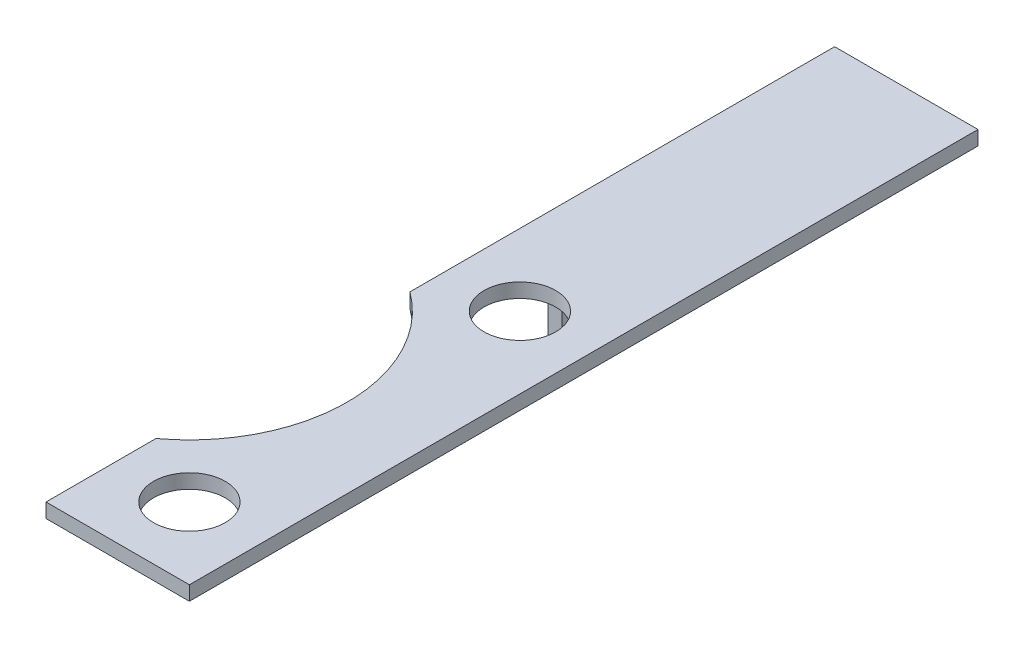
ISO-10303-21;
HEADER;
FILE_DESCRIPTION(('STEP AP214'),'2;1');
FILE_NAME('part.step','',(''),(''),'','','');
FILE_SCHEMA(('AUTOMOTIVE_DESIGN { 1 0 10303 214 1 1 1 1 }'));
ENDSEC;
DATA;
#1=APPLICATION_CONTEXT('core data for automotive mechanical design processes');
#2=APPLICATION_PROTOCOL_DEFINITION('international standard','automotive_design',2000,#1);
#3=PRODUCT_CONTEXT('',#1,'mechanical');
#4=PRODUCT('Part','Part','',(#3));
#5=PRODUCT_RELATED_PRODUCT_CATEGORY('part','',(#4));
#6=PRODUCT_DEFINITION_FORMATION('','',#4);
#7=PRODUCT_DEFINITION_CONTEXT('part definition',#1,'design');
#8=PRODUCT_DEFINITION('design','',#6,#7);
#9=PRODUCT_DEFINITION_SHAPE('','',#8);
#10=(LENGTH_UNIT() NAMED_UNIT(*) SI_UNIT(.MILLI.,.METRE.));
#11=(NAMED_UNIT(*) PLANE_ANGLE_UNIT() SI_UNIT($,.RADIAN.));
#12=(NAMED_UNIT(*) SI_UNIT($,.STERADIAN.) SOLID_ANGLE_UNIT());
#13=UNCERTAINTY_MEASURE_WITH_UNIT(LENGTH_MEASURE(1.E-05),#10,'distance_accuracy_value','');
#14=(GEOMETRIC_REPRESENTATION_CONTEXT(3) GLOBAL_UNCERTAINTY_ASSIGNED_CONTEXT((#13)) GLOBAL_UNIT_ASSIGNED_CONTEXT((#10,
#11,#12)) REPRESENTATION_CONTEXT('',''));
#15=CARTESIAN_POINT('',(0.,0.,0.));
#16=DIRECTION('',(0.,0.,1.));
#17=DIRECTION('',(1.,0.,0.));
#18=AXIS2_PLACEMENT_3D('',#15,#16,#17);
#19=CARTESIAN_POINT('',(1.,-10.,55.));
#20=DIRECTION('',(0.,1.,0.));
#21=DIRECTION('',(0.,0.,-1.));
#22=AXIS2_PLACEMENT_3D('',#19,#20,#21);
#23=PLANE('',#22);
#24=DIRECTION('',(-1.,0.,0.));
#25=VECTOR('',#24,1.);
#26=CARTESIAN_POINT('',(0.,-10.,20.));
#27=LINE('',#26,#25);
#28=CARTESIAN_POINT('',(0.999999999999999,-10.,20.));
#29=VERTEX_POINT('',#28);
#30=CARTESIAN_POINT('',(0.,-10.,20.));
#31=VERTEX_POINT('',#30);
#32=EDGE_CURVE('E146',#29,#31,#27,.T.);
#33=ORIENTED_EDGE('',*,*,#32,.T.);
#34=DIRECTION('',(0.,0.,-1.));
#35=VECTOR('',#34,1.);
#36=CARTESIAN_POINT('',(0.,-10.,55.));
#37=LINE('',#36,#35);
#38=CARTESIAN_POINT('',(0.,-10.,0.));
#39=VERTEX_POINT('',#38);
#40=EDGE_CURVE('E11',#31,#39,#37,.T.);
#41=ORIENTED_EDGE('',*,*,#40,.T.);
#42=DIRECTION('',(-1.,0.,0.));
#43=VECTOR('',#42,1.);
#44=CARTESIAN_POINT('',(1.,-10.,0.));
#45=LINE('',#44,#43);
#46=CARTESIAN_POINT('',(1.,-10.,0.));
#47=VERTEX_POINT('',#46);
#48=EDGE_CURVE('E166',#47,#39,#45,.T.);
#49=ORIENTED_EDGE('',*,*,#48,.F.);
#50=DIRECTION('',(0.,0.,-1.));
#51=VECTOR('',#50,1.);
#52=CARTESIAN_POINT('',(1.,-10.,55.));
#53=LINE('',#52,#51);
#54=EDGE_CURVE('E175',#29,#47,#53,.T.);
#55=ORIENTED_EDGE('',*,*,#54,.F.);
#56=EDGE_LOOP('',(#33,#41,#49,#55));
#57=FACE_BOUND('',#56,.T.);
#58=ADVANCED_FACE('F37',(#57),#23,.F.);
#59=CARTESIAN_POINT('',(0.,-10.,55.));
#60=DIRECTION('',(1.,0.,0.));
#61=DIRECTION('',(0.,0.,-1.));
#62=AXIS2_PLACEMENT_3D('',#59,#60,#61);
#63=PLANE('',#62);
#64=DIRECTION('',(0.,1.,0.));
#65=VECTOR('',#64,1.);
#66=CARTESIAN_POINT('',(0.,-10.,55.));
#67=LINE('',#66,#65);
#68=CARTESIAN_POINT('',(0.,-0.999999999999999,55.));
#69=VERTEX_POINT('',#68);
#70=CARTESIAN_POINT('',(0.,0.,55.));
#71=VERTEX_POINT('',#70);
#72=EDGE_CURVE('E167',#69,#71,#67,.T.);
#73=ORIENTED_EDGE('',*,*,#72,.T.);
#74=DIRECTION('',(0.,0.,-1.));
#75=VECTOR('',#74,1.);
#76=CARTESIAN_POINT('',(0.,0.,55.));
#77=LINE('',#76,#75);
#78=CARTESIAN_POINT('',(0.,0.,47.3307537793234));
#79=VERTEX_POINT('',#78);
#80=EDGE_CURVE('E44',#71,#79,#77,.T.);
#81=ORIENTED_EDGE('',*,*,#80,.T.);
#82=DIRECTION('',(0.,-1.,0.));
#83=VECTOR('',#82,1.);
#84=CARTESIAN_POINT('',(0.,0.,47.3307537793234));
#85=LINE('',#84,#83);
#86=CARTESIAN_POINT('',(0.,-0.999999999999999,47.3307537793234));
#87=VERTEX_POINT('',#86);
#88=EDGE_CURVE('E160',#87,#79,#85,.F.);
#89=ORIENTED_EDGE('',*,*,#88,.F.);
#90=DIRECTION('',(0.,0.,1.));
#91=VECTOR('',#90,1.);
#92=CARTESIAN_POINT('',(0.,-0.999999999999999,20.));
#93=LINE('',#92,#91);
#94=EDGE_CURVE('E134',#87,#69,#93,.T.);
#95=ORIENTED_EDGE('',*,*,#94,.T.);
#96=EDGE_LOOP('',(#73,#81,#89,#95));
#97=FACE_BOUND('',#96,.T.);
#98=ADVANCED_FACE('F226',(#97),#63,.F.);
#99=CARTESIAN_POINT('',(0.999999999999999,-0.999999999999999,55.));
#100=DIRECTION('',(-1.,0.,0.));
#101=DIRECTION('',(0.,1.,0.));
#102=AXIS2_PLACEMENT_3D('',#99,#100,#101);
#103=PLANE('',#102);
#104=CARTESIAN_POINT('',(0.999999999999999,-4.,5.1));
#105=DIRECTION('',(1.,0.,0.));
#106=DIRECTION('',(0.,1.,0.));
#107=AXIS2_PLACEMENT_3D('',#104,#105,#106);
#108=CIRCLE('',#107,2.25);
#109=CARTESIAN_POINT('',(0.999999999999999,-1.75,5.1));
#110=VERTEX_POINT('',#109);
#111=EDGE_CURVE('E138',#110,#110,#108,.T.);
#112=ORIENTED_EDGE('',*,*,#111,.F.);
#113=EDGE_LOOP('',(#112));
#114=FACE_BOUND('',#113,.T.);
#115=CARTESIAN_POINT('',(0.999999999999999,-4.,15.1));
#116=DIRECTION('',(1.,0.,0.));
#117=DIRECTION('',(0.,1.,0.));
#118=AXIS2_PLACEMENT_3D('',#115,#116,#117);
#119=CIRCLE('',#118,2.25);
#120=CARTESIAN_POINT('',(0.999999999999999,-1.75,15.1));
#121=VERTEX_POINT('',#120);
#122=EDGE_CURVE('E141',#121,#121,#119,.T.);
#123=ORIENTED_EDGE('',*,*,#122,.F.);
#124=EDGE_LOOP('',(#123));
#125=FACE_BOUND('',#124,.T.);
#126=DIRECTION('',(0.,-1.,0.));
#127=VECTOR('',#126,1.);
#128=CARTESIAN_POINT('',(0.999999999999999,-10.,20.));
#129=LINE('',#128,#127);
#130=CARTESIAN_POINT('',(0.999999999999999,-0.999999999999999,20.));
#131=VERTEX_POINT('',#130);
#132=EDGE_CURVE('E122',#131,#29,#129,.T.);
#133=ORIENTED_EDGE('',*,*,#132,.T.);
#134=ORIENTED_EDGE('',*,*,#54,.T.);
#135=DIRECTION('',(0.,-1.,0.));
#136=VECTOR('',#135,1.);
#137=CARTESIAN_POINT('',(0.999999999999999,-0.999999999999999,0.));
#138=LINE('',#137,#136);
#139=CARTESIAN_POINT('',(0.999999999999999,-0.999999999999999,0.));
#140=VERTEX_POINT('',#139);
#141=EDGE_CURVE('E86',#140,#47,#138,.T.);
#142=ORIENTED_EDGE('',*,*,#141,.F.);
#143=DIRECTION('',(0.,0.,-1.));
#144=VECTOR('',#143,1.);
#145=CARTESIAN_POINT('',(0.999999999999999,-0.999999999999999,55.));
#146=LINE('',#145,#144);
#147=EDGE_CURVE('E190',#131,#140,#146,.T.);
#148=ORIENTED_EDGE('',*,*,#147,.F.);
#149=EDGE_LOOP('',(#133,#134,#142,#148));
#150=FACE_BOUND('',#149,.T.);
#151=ADVANCED_FACE('F210',(#114,#125,#150),#103,.F.);
#152=CARTESIAN_POINT('',(0.,-4.,5.1));
#153=DIRECTION('',(1.,0.,0.));
#154=DIRECTION('',(0.,0.,1.));
#155=AXIS2_PLACEMENT_3D('',#152,#153,#154);
#156=CIRCLE('',#155,2.25);
#157=CARTESIAN_POINT('',(0.,-4.,7.35));
#158=VERTEX_POINT('',#157);
#159=EDGE_CURVE('E245',#158,#158,#156,.T.);
#160=ORIENTED_EDGE('',*,*,#159,.T.);
#161=EDGE_LOOP('',(#160));
#162=FACE_BOUND('',#161,.T.);
#163=CARTESIAN_POINT('',(0.,-4.,15.1));
#164=DIRECTION('',(1.,0.,0.));
#165=DIRECTION('',(0.,0.,1.));
#166=AXIS2_PLACEMENT_3D('',#163,#164,#165);
#167=CIRCLE('',#166,2.25);
#168=CARTESIAN_POINT('',(0.,-4.,17.35));
#169=VERTEX_POINT('',#168);
#170=EDGE_CURVE('E248',#169,#169,#167,.T.);
#171=ORIENTED_EDGE('',*,*,#170,.T.);
#172=EDGE_LOOP('',(#171));
#173=FACE_BOUND('',#172,.T.);
#174=DIRECTION('',(0.,-1.,0.));
#175=VECTOR('',#174,1.);
#176=CARTESIAN_POINT('',(0.,0.,29.6192462206766));
#177=LINE('',#176,#175);
#178=CARTESIAN_POINT('',(0.,0.,29.6192462206766));
#179=VERTEX_POINT('',#178);
#180=CARTESIAN_POINT('',(0.,-0.999999999999999,29.6192462206766));
#181=VERTEX_POINT('',#180);
#182=EDGE_CURVE('E164',#179,#181,#177,.T.);
#183=ORIENTED_EDGE('',*,*,#182,.F.);
#184=CARTESIAN_POINT('',(0.,0.,0.));
#185=VERTEX_POINT('',#184);
#186=EDGE_CURVE('E197',#179,#185,#77,.T.);
#187=ORIENTED_EDGE('',*,*,#186,.T.);
#188=DIRECTION('',(0.,1.,0.));
#189=VECTOR('',#188,1.);
#190=CARTESIAN_POINT('',(0.,-10.,0.));
#191=LINE('',#190,#189);
#192=EDGE_CURVE('E177',#39,#185,#191,.T.);
#193=ORIENTED_EDGE('',*,*,#192,.F.);
#194=ORIENTED_EDGE('',*,*,#40,.F.);
#195=DIRECTION('',(0.,1.,0.));
#196=VECTOR('',#195,1.);
#197=CARTESIAN_POINT('',(0.,-10.,20.));
#198=LINE('',#197,#196);
#199=CARTESIAN_POINT('',(0.,-0.999999999999999,20.));
#200=VERTEX_POINT('',#199);
#201=EDGE_CURVE('E120',#31,#200,#198,.T.);
#202=ORIENTED_EDGE('',*,*,#201,.T.);
#203=EDGE_CURVE('E128',#200,#181,#93,.T.);
#204=ORIENTED_EDGE('',*,*,#203,.T.);
#205=EDGE_LOOP('',(#183,#187,#193,#194,#202,#204));
#206=FACE_BOUND('',#205,.T.);
#207=ADVANCED_FACE('F136',(#162,#173,#206),#63,.F.);
#208=CARTESIAN_POINT('',(0.,0.,55.));
#209=DIRECTION('',(0.,-1.,0.));
#210=DIRECTION('',(0.,0.,1.));
#211=AXIS2_PLACEMENT_3D('',#208,#209,#210);
#212=PLANE('',#211);
#213=CARTESIAN_POINT('',(5.,0.,26.95));
#214=DIRECTION('',(0.,1.,0.));
#215=DIRECTION('',(-1.,0.,0.));
#216=AXIS2_PLACEMENT_3D('',#213,#214,#215);
#217=CIRCLE('',#216,2.5);
#218=CARTESIAN_POINT('',(2.5,0.,26.95));
#219=VERTEX_POINT('',#218);
#220=EDGE_CURVE('E151',#219,#219,#217,.T.);
#221=ORIENTED_EDGE('',*,*,#220,.F.);
#222=EDGE_LOOP('',(#221));
#223=FACE_BOUND('',#222,.T.);
#224=CARTESIAN_POINT('',(5.,0.,50.));
#225=DIRECTION('',(0.,1.,0.));
#226=DIRECTION('',(-1.,0.,0.));
#227=AXIS2_PLACEMENT_3D('',#224,#225,#226);
#228=CIRCLE('',#227,2.5);
#229=CARTESIAN_POINT('',(2.5,0.,50.));
#230=VERTEX_POINT('',#229);
#231=EDGE_CURVE('E157',#230,#230,#228,.T.);
#232=ORIENTED_EDGE('',*,*,#231,.F.);
#233=EDGE_LOOP('',(#232));
#234=FACE_BOUND('',#233,.T.);
#235=ORIENTED_EDGE('',*,*,#80,.F.);
#236=DIRECTION('',(1.,0.,0.));
#237=VECTOR('',#236,1.);
#238=CARTESIAN_POINT('',(0.,0.,55.));
#239=LINE('',#238,#237);
#240=CARTESIAN_POINT('',(10.,0.,55.));
#241=VERTEX_POINT('',#240);
#242=EDGE_CURVE('E90',#71,#241,#239,.T.);
#243=ORIENTED_EDGE('',*,*,#242,.T.);
#244=DIRECTION('',(0.,0.,-1.));
#245=VECTOR('',#244,1.);
#246=CARTESIAN_POINT('',(10.,0.,55.));
#247=LINE('',#246,#245);
#248=CARTESIAN_POINT('',(10.,0.,0.));
#249=VERTEX_POINT('',#248);
#250=EDGE_CURVE('E195',#241,#249,#247,.T.);
#251=ORIENTED_EDGE('',*,*,#250,.T.);
#252=DIRECTION('',(1.,0.,0.));
#253=VECTOR('',#252,1.);
#254=CARTESIAN_POINT('',(0.,0.,0.));
#255=LINE('',#254,#253);
#256=EDGE_CURVE('E180',#185,#249,#255,.T.);
#257=ORIENTED_EDGE('',*,*,#256,.F.);
#258=ORIENTED_EDGE('',*,*,#186,.F.);
#259=CARTESIAN_POINT('',(-6.525,0.,38.475));
#260=DIRECTION('',(0.,1.,0.));
#261=DIRECTION('',(1.,0.,0.));
#262=AXIS2_PLACEMENT_3D('',#259,#260,#261);
#263=CIRCLE('',#262,11.);
#264=EDGE_CURVE('E51',#79,#179,#263,.T.);
#265=ORIENTED_EDGE('',*,*,#264,.F.);
#266=EDGE_LOOP('',(#235,#243,#251,#257,#258,#265));
#267=FACE_BOUND('',#266,.T.);
#268=ADVANCED_FACE('F203',(#223,#234,#267),#212,.F.);
#269=CARTESIAN_POINT('',(10.,0.,55.));
#270=DIRECTION('',(-1.,0.,0.));
#271=DIRECTION('',(0.,0.,1.));
#272=AXIS2_PLACEMENT_3D('',#269,#270,#271);
#273=PLANE('',#272);
#274=DIRECTION('',(0.,-1.,0.));
#275=VECTOR('',#274,1.);
#276=CARTESIAN_POINT('',(10.,0.,0.));
#277=LINE('',#276,#275);
#278=CARTESIAN_POINT('',(10.,-1.,0.));
#279=VERTEX_POINT('',#278);
#280=EDGE_CURVE('E183',#249,#279,#277,.T.);
#281=ORIENTED_EDGE('',*,*,#280,.F.);
#282=ORIENTED_EDGE('',*,*,#250,.F.);
#283=DIRECTION('',(0.,-1.,0.));
#284=VECTOR('',#283,1.);
#285=CARTESIAN_POINT('',(10.,0.,55.));
#286=LINE('',#285,#284);
#287=CARTESIAN_POINT('',(10.,-1.,55.));
#288=VERTEX_POINT('',#287);
#289=EDGE_CURVE('E171',#241,#288,#286,.T.);
#290=ORIENTED_EDGE('',*,*,#289,.T.);
#291=DIRECTION('',(0.,0.,-1.));
#292=VECTOR('',#291,1.);
#293=CARTESIAN_POINT('',(10.,-1.,55.));
#294=LINE('',#293,#292);
#295=EDGE_CURVE('E192',#288,#279,#294,.T.);
#296=ORIENTED_EDGE('',*,*,#295,.T.);
#297=EDGE_LOOP('',(#281,#282,#290,#296));
#298=FACE_BOUND('',#297,.T.);
#299=ADVANCED_FACE('F212',(#298),#273,.F.);
#300=CARTESIAN_POINT('',(10.,-1.,55.));
#301=DIRECTION('',(0.,1.,0.));
#302=DIRECTION('',(1.,0.,0.));
#303=AXIS2_PLACEMENT_3D('',#300,#301,#302);
#304=PLANE('',#303);
#305=CARTESIAN_POINT('',(5.,-0.999999999999999,26.95));
#306=DIRECTION('',(0.,1.,0.));
#307=DIRECTION('',(-1.,0.,0.));
#308=AXIS2_PLACEMENT_3D('',#305,#306,#307);
#309=CIRCLE('',#308,2.5);
#310=CARTESIAN_POINT('',(2.5,-0.999999999999999,26.95));
#311=VERTEX_POINT('',#310);
#312=EDGE_CURVE('E149',#311,#311,#309,.T.);
#313=ORIENTED_EDGE('',*,*,#312,.T.);
#314=EDGE_LOOP('',(#313));
#315=FACE_BOUND('',#314,.T.);
#316=CARTESIAN_POINT('',(5.,-0.999999999999999,50.));
#317=DIRECTION('',(0.,1.,0.));
#318=DIRECTION('',(-1.,0.,0.));
#319=AXIS2_PLACEMENT_3D('',#316,#317,#318);
#320=CIRCLE('',#319,2.5);
#321=CARTESIAN_POINT('',(2.5,-0.999999999999999,50.));
#322=VERTEX_POINT('',#321);
#323=EDGE_CURVE('E154',#322,#322,#320,.T.);
#324=ORIENTED_EDGE('',*,*,#323,.T.);
#325=EDGE_LOOP('',(#324));
#326=FACE_BOUND('',#325,.T.);
#327=ORIENTED_EDGE('',*,*,#147,.T.);
#328=DIRECTION('',(-1.,0.,0.));
#329=VECTOR('',#328,1.);
#330=CARTESIAN_POINT('',(10.,-1.,0.));
#331=LINE('',#330,#329);
#332=EDGE_CURVE('E186',#279,#140,#331,.T.);
#333=ORIENTED_EDGE('',*,*,#332,.F.);
#334=ORIENTED_EDGE('',*,*,#295,.F.);
#335=DIRECTION('',(-1.,0.,0.));
#336=VECTOR('',#335,1.);
#337=CARTESIAN_POINT('',(10.,-1.,55.));
#338=LINE('',#337,#336);
#339=EDGE_CURVE('E60',#288,#69,#338,.T.);
#340=ORIENTED_EDGE('',*,*,#339,.T.);
#341=ORIENTED_EDGE('',*,*,#94,.F.);
#342=CARTESIAN_POINT('',(-6.525,-0.999999999999998,38.475));
#343=DIRECTION('',(0.,1.,0.));
#344=DIRECTION('',(1.,0.,0.));
#345=AXIS2_PLACEMENT_3D('',#342,#343,#344);
#346=CIRCLE('',#345,11.);
#347=EDGE_CURVE('E131',#87,#181,#346,.T.);
#348=ORIENTED_EDGE('',*,*,#347,.T.);
#349=ORIENTED_EDGE('',*,*,#203,.F.);
#350=DIRECTION('',(1.,0.,0.));
#351=VECTOR('',#350,1.);
#352=CARTESIAN_POINT('',(0.,-0.999999999999999,20.));
#353=LINE('',#352,#351);
#354=EDGE_CURVE('E115',#200,#131,#353,.T.);
#355=ORIENTED_EDGE('',*,*,#354,.T.);
#356=EDGE_LOOP('',(#327,#333,#334,#340,#341,#348,#349,#355));
#357=FACE_BOUND('',#356,.T.);
#358=ADVANCED_FACE('F129',(#315,#326,#357),#304,.F.);
#359=CARTESIAN_POINT('',(0.,0.,55.));
#360=DIRECTION('',(0.,0.,1.));
#361=DIRECTION('',(1.,0.,0.));
#362=AXIS2_PLACEMENT_3D('',#359,#360,#361);
#363=PLANE('',#362);
#364=ORIENTED_EDGE('',*,*,#339,.F.);
#365=ORIENTED_EDGE('',*,*,#289,.F.);
#366=ORIENTED_EDGE('',*,*,#242,.F.);
#367=ORIENTED_EDGE('',*,*,#72,.F.);
#368=EDGE_LOOP('',(#364,#365,#366,#367));
#369=FACE_BOUND('',#368,.T.);
#370=ADVANCED_FACE('F213',(#369),#363,.T.);
#371=CARTESIAN_POINT('',(0.,0.,0.));
#372=DIRECTION('',(0.,0.,1.));
#373=DIRECTION('',(1.,0.,0.));
#374=AXIS2_PLACEMENT_3D('',#371,#372,#373);
#375=PLANE('',#374);
#376=ORIENTED_EDGE('',*,*,#48,.T.);
#377=ORIENTED_EDGE('',*,*,#192,.T.);
#378=ORIENTED_EDGE('',*,*,#256,.T.);
#379=ORIENTED_EDGE('',*,*,#280,.T.);
#380=ORIENTED_EDGE('',*,*,#332,.T.);
#381=ORIENTED_EDGE('',*,*,#141,.T.);
#382=EDGE_LOOP('',(#376,#377,#378,#379,#380,#381));
#383=FACE_BOUND('',#382,.T.);
#384=ADVANCED_FACE('F205',(#383),#375,.F.);
#385=CARTESIAN_POINT('',(-6.525,0.,38.475));
#386=DIRECTION('',(0.,-1.,0.));
#387=DIRECTION('',(-1.,0.,0.));
#388=AXIS2_PLACEMENT_3D('',#385,#386,#387);
#389=CYLINDRICAL_SURFACE('',#388,11.);
#390=ORIENTED_EDGE('',*,*,#264,.T.);
#391=ORIENTED_EDGE('',*,*,#182,.T.);
#392=ORIENTED_EDGE('',*,*,#347,.F.);
#393=ORIENTED_EDGE('',*,*,#88,.T.);
#394=EDGE_LOOP('',(#390,#391,#392,#393));
#395=FACE_BOUND('',#394,.T.);
#396=ADVANCED_FACE('F220',(#395),#389,.F.);
#397=CARTESIAN_POINT('',(5.,0.,50.));
#398=DIRECTION('',(0.,-1.,0.));
#399=DIRECTION('',(-1.,0.,0.));
#400=AXIS2_PLACEMENT_3D('',#397,#398,#399);
#401=CYLINDRICAL_SURFACE('',#400,2.5);
#402=ORIENTED_EDGE('',*,*,#231,.T.);
#403=EDGE_LOOP('',(#402));
#404=FACE_BOUND('',#403,.T.);
#405=ORIENTED_EDGE('',*,*,#323,.F.);
#406=EDGE_LOOP('',(#405));
#407=FACE_BOUND('',#406,.T.);
#408=ADVANCED_FACE('F271',(#404,#407),#401,.F.);
#409=CARTESIAN_POINT('',(5.,0.,26.95));
#410=DIRECTION('',(0.,-1.,0.));
#411=DIRECTION('',(-1.,0.,0.));
#412=AXIS2_PLACEMENT_3D('',#409,#410,#411);
#413=CYLINDRICAL_SURFACE('',#412,2.5);
#414=ORIENTED_EDGE('',*,*,#220,.T.);
#415=EDGE_LOOP('',(#414));
#416=FACE_BOUND('',#415,.T.);
#417=ORIENTED_EDGE('',*,*,#312,.F.);
#418=EDGE_LOOP('',(#417));
#419=FACE_BOUND('',#418,.T.);
#420=ADVANCED_FACE('F266',(#416,#419),#413,.F.);
#421=CARTESIAN_POINT('',(0.,0.,20.));
#422=DIRECTION('',(0.,0.,1.));
#423=DIRECTION('',(1.,0.,0.));
#424=AXIS2_PLACEMENT_3D('',#421,#422,#423);
#425=PLANE('',#424);
#426=ORIENTED_EDGE('',*,*,#201,.F.);
#427=ORIENTED_EDGE('',*,*,#32,.F.);
#428=ORIENTED_EDGE('',*,*,#132,.F.);
#429=ORIENTED_EDGE('',*,*,#354,.F.);
#430=EDGE_LOOP('',(#426,#427,#428,#429));
#431=FACE_BOUND('',#430,.T.);
#432=ADVANCED_FACE('F117',(#431),#425,.T.);
#433=CARTESIAN_POINT('',(10.,-4.,15.1));
#434=DIRECTION('',(-1.,0.,0.));
#435=DIRECTION('',(0.,0.,1.));
#436=AXIS2_PLACEMENT_3D('',#433,#434,#435);
#437=CYLINDRICAL_SURFACE('',#436,2.25);
#438=ORIENTED_EDGE('',*,*,#170,.F.);
#439=EDGE_LOOP('',(#438));
#440=FACE_BOUND('',#439,.T.);
#441=ORIENTED_EDGE('',*,*,#122,.T.);
#442=EDGE_LOOP('',(#441));
#443=FACE_BOUND('',#442,.T.);
#444=ADVANCED_FACE('F255',(#440,#443),#437,.F.);
#445=CARTESIAN_POINT('',(10.,-4.,5.1));
#446=DIRECTION('',(-1.,0.,0.));
#447=DIRECTION('',(0.,0.,1.));
#448=AXIS2_PLACEMENT_3D('',#445,#446,#447);
#449=CYLINDRICAL_SURFACE('',#448,2.25);
#450=ORIENTED_EDGE('',*,*,#159,.F.);
#451=EDGE_LOOP('',(#450));
#452=FACE_BOUND('',#451,.T.);
#453=ORIENTED_EDGE('',*,*,#111,.T.);
#454=EDGE_LOOP('',(#453));
#455=FACE_BOUND('',#454,.T.);
#456=ADVANCED_FACE('F258',(#452,#455),#449,.F.);
#457=CLOSED_SHELL('',(#58,#98,#151,#207,#268,#299,#358,#370,#384,#396,#408,#420,#432,#444,#456));
#458=MANIFOLD_SOLID_BREP('B2',#457);
#459=ADVANCED_BREP_SHAPE_REPRESENTATION('',(#18,#458),#14);
#460=SHAPE_DEFINITION_REPRESENTATION(#9,#459);
ENDSEC;
END-ISO-10303-21;
